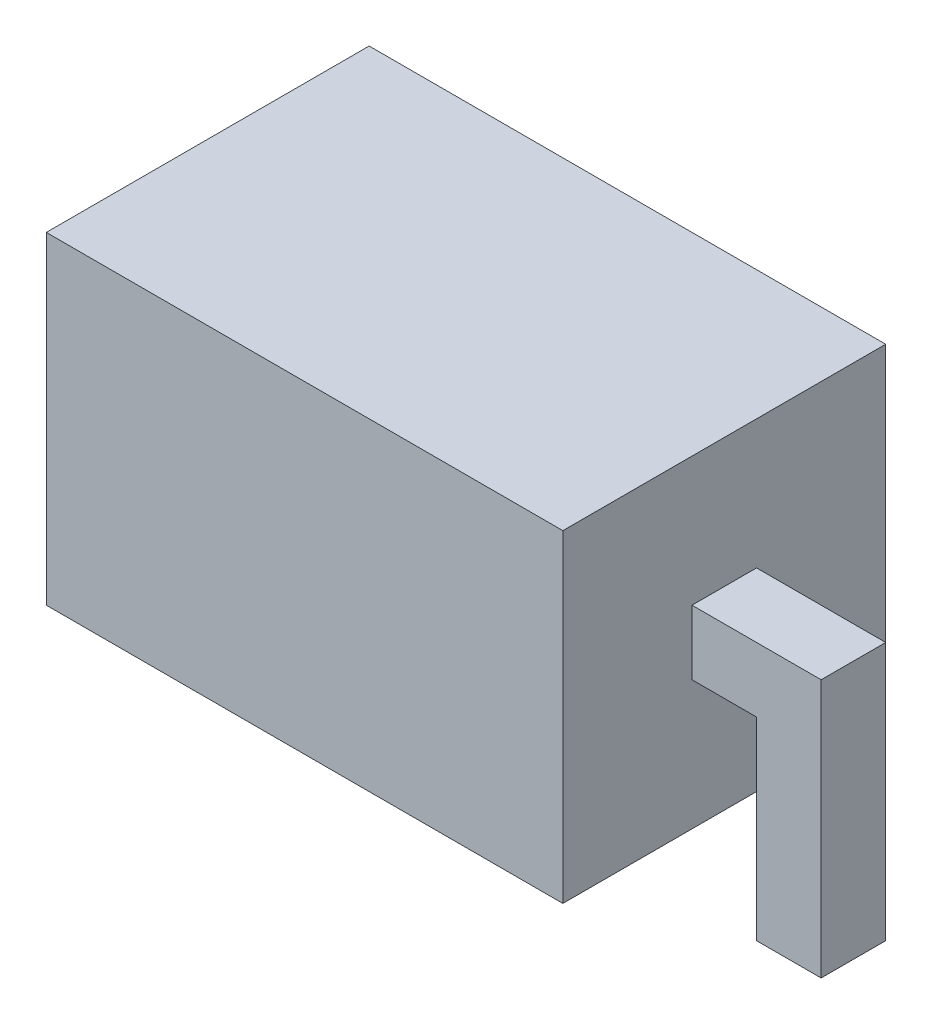
ISO-10303-21;
HEADER;
FILE_DESCRIPTION(('STEP AP214'),'2;1');
FILE_NAME('part.step','',(''),(''),'','','');
FILE_SCHEMA(('AUTOMOTIVE_DESIGN { 1 0 10303 214 1 1 1 1 }'));
ENDSEC;
DATA;
#1=APPLICATION_CONTEXT('core data for automotive mechanical design processes');
#2=APPLICATION_PROTOCOL_DEFINITION('international standard','automotive_design',2000,#1);
#3=PRODUCT_CONTEXT('',#1,'mechanical');
#4=PRODUCT('Part','Part','',(#3));
#5=PRODUCT_RELATED_PRODUCT_CATEGORY('part','',(#4));
#6=PRODUCT_DEFINITION_FORMATION('','',#4);
#7=PRODUCT_DEFINITION_CONTEXT('part definition',#1,'design');
#8=PRODUCT_DEFINITION('design','',#6,#7);
#9=PRODUCT_DEFINITION_SHAPE('','',#8);
#10=(LENGTH_UNIT() NAMED_UNIT(*) SI_UNIT(.MILLI.,.METRE.));
#11=(NAMED_UNIT(*) PLANE_ANGLE_UNIT() SI_UNIT($,.RADIAN.));
#12=(NAMED_UNIT(*) SI_UNIT($,.STERADIAN.) SOLID_ANGLE_UNIT());
#13=UNCERTAINTY_MEASURE_WITH_UNIT(LENGTH_MEASURE(1.E-05),#10,'distance_accuracy_value','');
#14=(GEOMETRIC_REPRESENTATION_CONTEXT(3) GLOBAL_UNCERTAINTY_ASSIGNED_CONTEXT((#13)) GLOBAL_UNIT_ASSIGNED_CONTEXT((#10,
#11,#12)) REPRESENTATION_CONTEXT('',''));
#15=CARTESIAN_POINT('',(0.,0.,0.));
#16=DIRECTION('',(0.,0.,1.));
#17=DIRECTION('',(1.,0.,0.));
#18=AXIS2_PLACEMENT_3D('',#15,#16,#17);
#19=CARTESIAN_POINT('',(2.,-1.25,2.5));
#20=DIRECTION('',(-1.,0.,0.));
#21=DIRECTION('',(0.,0.,1.));
#22=AXIS2_PLACEMENT_3D('',#19,#20,#21);
#23=PLANE('',#22);
#24=DIRECTION('',(0.,1.,0.));
#25=VECTOR('',#24,1.);
#26=CARTESIAN_POINT('',(2.,0.,1.));
#27=LINE('',#26,#25);
#28=CARTESIAN_POINT('',(1.99999999999999,-0.25,1.));
#29=VERTEX_POINT('',#28);
#30=CARTESIAN_POINT('',(2.,0.25,1.));
#31=VERTEX_POINT('',#30);
#32=EDGE_CURVE('E230',#29,#31,#27,.T.);
#33=ORIENTED_EDGE('',*,*,#32,.F.);
#34=DIRECTION('',(0.,0.,1.));
#35=VECTOR('',#34,1.);
#36=CARTESIAN_POINT('',(1.99999999999999,-0.25,1.));
#37=LINE('',#36,#35);
#38=CARTESIAN_POINT('',(1.99999999999999,-0.25,1.5));
#39=VERTEX_POINT('',#38);
#40=EDGE_CURVE('E58',#29,#39,#37,.T.);
#41=ORIENTED_EDGE('',*,*,#40,.T.);
#42=DIRECTION('',(0.,1.,0.));
#43=VECTOR('',#42,1.);
#44=CARTESIAN_POINT('',(2.,0.,1.5));
#45=LINE('',#44,#43);
#46=CARTESIAN_POINT('',(2.,0.25,1.5));
#47=VERTEX_POINT('',#46);
#48=EDGE_CURVE('E214',#39,#47,#45,.T.);
#49=ORIENTED_EDGE('',*,*,#48,.T.);
#50=DIRECTION('',(0.,0.,1.));
#51=VECTOR('',#50,1.);
#52=CARTESIAN_POINT('',(2.,0.25,1.));
#53=LINE('',#52,#51);
#54=EDGE_CURVE('E246',#31,#47,#53,.T.);
#55=ORIENTED_EDGE('',*,*,#54,.F.);
#56=EDGE_LOOP('',(#33,#41,#49,#55));
#57=FACE_BOUND('',#56,.T.);
#58=DIRECTION('',(0.,1.,0.));
#59=VECTOR('',#58,1.);
#60=CARTESIAN_POINT('',(2.,-1.25,0.));
#61=LINE('',#60,#59);
#62=CARTESIAN_POINT('',(2.,-1.25,0.));
#63=VERTEX_POINT('',#62);
#64=CARTESIAN_POINT('',(2.,1.25,0.));
#65=VERTEX_POINT('',#64);
#66=EDGE_CURVE('E242',#63,#65,#61,.T.);
#67=ORIENTED_EDGE('',*,*,#66,.T.);
#68=DIRECTION('',(0.,0.,-1.));
#69=VECTOR('',#68,1.);
#70=CARTESIAN_POINT('',(2.,1.25,2.5));
#71=LINE('',#70,#69);
#72=CARTESIAN_POINT('',(2.,1.25,2.5));
#73=VERTEX_POINT('',#72);
#74=EDGE_CURVE('E11',#73,#65,#71,.T.);
#75=ORIENTED_EDGE('',*,*,#74,.F.);
#76=DIRECTION('',(0.,1.,0.));
#77=VECTOR('',#76,1.);
#78=CARTESIAN_POINT('',(2.,-1.25,2.5));
#79=LINE('',#78,#77);
#80=CARTESIAN_POINT('',(2.,-1.25,2.5));
#81=VERTEX_POINT('',#80);
#82=EDGE_CURVE('E252',#81,#73,#79,.T.);
#83=ORIENTED_EDGE('',*,*,#82,.F.);
#84=DIRECTION('',(0.,0.,-1.));
#85=VECTOR('',#84,1.);
#86=CARTESIAN_POINT('',(2.,-1.25,2.5));
#87=LINE('',#86,#85);
#88=EDGE_CURVE('E262',#81,#63,#87,.T.);
#89=ORIENTED_EDGE('',*,*,#88,.T.);
#90=EDGE_LOOP('',(#67,#75,#83,#89));
#91=FACE_BOUND('',#90,.T.);
#92=ADVANCED_FACE('F36',(#57,#91),#23,.F.);
#93=CARTESIAN_POINT('',(-2.,1.25,2.5));
#94=DIRECTION('',(0.,-1.,0.));
#95=DIRECTION('',(0.,0.,-1.));
#96=AXIS2_PLACEMENT_3D('',#93,#94,#95);
#97=PLANE('',#96);
#98=DIRECTION('',(-1.,0.,0.));
#99=VECTOR('',#98,1.);
#100=CARTESIAN_POINT('',(-2.,1.25,0.));
#101=LINE('',#100,#99);
#102=CARTESIAN_POINT('',(-2.,1.25,0.));
#103=VERTEX_POINT('',#102);
#104=EDGE_CURVE('E265',#65,#103,#101,.T.);
#105=ORIENTED_EDGE('',*,*,#104,.T.);
#106=DIRECTION('',(0.,0.,-1.));
#107=VECTOR('',#106,1.);
#108=CARTESIAN_POINT('',(-2.,1.25,2.5));
#109=LINE('',#108,#107);
#110=CARTESIAN_POINT('',(-2.,1.25,2.5));
#111=VERTEX_POINT('',#110);
#112=EDGE_CURVE('E43',#111,#103,#109,.T.);
#113=ORIENTED_EDGE('',*,*,#112,.F.);
#114=DIRECTION('',(-1.,0.,0.));
#115=VECTOR('',#114,1.);
#116=CARTESIAN_POINT('',(-2.,1.25,2.5));
#117=LINE('',#116,#115);
#118=EDGE_CURVE('E255',#73,#111,#117,.T.);
#119=ORIENTED_EDGE('',*,*,#118,.F.);
#120=ORIENTED_EDGE('',*,*,#74,.T.);
#121=EDGE_LOOP('',(#105,#113,#119,#120));
#122=FACE_BOUND('',#121,.T.);
#123=ADVANCED_FACE('F295',(#122),#97,.F.);
#124=CARTESIAN_POINT('',(-2.,-1.25,2.5));
#125=DIRECTION('',(1.,0.,0.));
#126=DIRECTION('',(0.,0.,-1.));
#127=AXIS2_PLACEMENT_3D('',#124,#125,#126);
#128=PLANE('',#127);
#129=DIRECTION('',(0.,1.,0.));
#130=VECTOR('',#129,1.);
#131=CARTESIAN_POINT('',(-1.99999999999999,0.,1.));
#132=LINE('',#131,#130);
#133=CARTESIAN_POINT('',(-1.99999999999999,-0.25,1.));
#134=VERTEX_POINT('',#133);
#135=CARTESIAN_POINT('',(-2.,0.25,1.));
#136=VERTEX_POINT('',#135);
#137=EDGE_CURVE('E188',#134,#136,#132,.T.);
#138=ORIENTED_EDGE('',*,*,#137,.T.);
#139=DIRECTION('',(0.,0.,1.));
#140=VECTOR('',#139,1.);
#141=CARTESIAN_POINT('',(-2.,0.25,1.));
#142=LINE('',#141,#140);
#143=CARTESIAN_POINT('',(-2.,0.25,1.5));
#144=VERTEX_POINT('',#143);
#145=EDGE_CURVE('E202',#136,#144,#142,.T.);
#146=ORIENTED_EDGE('',*,*,#145,.T.);
#147=DIRECTION('',(0.,1.,0.));
#148=VECTOR('',#147,1.);
#149=CARTESIAN_POINT('',(-1.99999999999999,0.,1.5));
#150=LINE('',#149,#148);
#151=CARTESIAN_POINT('',(-1.99999999999999,-0.25,1.5));
#152=VERTEX_POINT('',#151);
#153=EDGE_CURVE('E169',#152,#144,#150,.T.);
#154=ORIENTED_EDGE('',*,*,#153,.F.);
#155=DIRECTION('',(0.,0.,1.));
#156=VECTOR('',#155,1.);
#157=CARTESIAN_POINT('',(-1.99999999999999,-0.25,1.));
#158=LINE('',#157,#156);
#159=EDGE_CURVE('E160',#134,#152,#158,.T.);
#160=ORIENTED_EDGE('',*,*,#159,.F.);
#161=EDGE_LOOP('',(#138,#146,#154,#160));
#162=FACE_BOUND('',#161,.T.);
#163=DIRECTION('',(0.,-1.,0.));
#164=VECTOR('',#163,1.);
#165=CARTESIAN_POINT('',(-2.,-1.25,0.));
#166=LINE('',#165,#164);
#167=CARTESIAN_POINT('',(-2.,-1.25,0.));
#168=VERTEX_POINT('',#167);
#169=EDGE_CURVE('E267',#103,#168,#166,.T.);
#170=ORIENTED_EDGE('',*,*,#169,.T.);
#171=DIRECTION('',(0.,0.,-1.));
#172=VECTOR('',#171,1.);
#173=CARTESIAN_POINT('',(-2.,-1.25,2.5));
#174=LINE('',#173,#172);
#175=CARTESIAN_POINT('',(-2.,-1.25,2.5));
#176=VERTEX_POINT('',#175);
#177=EDGE_CURVE('E272',#176,#168,#174,.T.);
#178=ORIENTED_EDGE('',*,*,#177,.F.);
#179=DIRECTION('',(0.,-1.,0.));
#180=VECTOR('',#179,1.);
#181=CARTESIAN_POINT('',(-2.,-1.25,2.5));
#182=LINE('',#181,#180);
#183=EDGE_CURVE('E258',#111,#176,#182,.T.);
#184=ORIENTED_EDGE('',*,*,#183,.F.);
#185=ORIENTED_EDGE('',*,*,#112,.T.);
#186=EDGE_LOOP('',(#170,#178,#184,#185));
#187=FACE_BOUND('',#186,.T.);
#188=ADVANCED_FACE('F279',(#162,#187),#128,.F.);
#189=CARTESIAN_POINT('',(-2.,-1.25,2.5));
#190=DIRECTION('',(0.,1.,0.));
#191=DIRECTION('',(0.,0.,1.));
#192=AXIS2_PLACEMENT_3D('',#189,#190,#191);
#193=PLANE('',#192);
#194=DIRECTION('',(1.,0.,0.));
#195=VECTOR('',#194,1.);
#196=CARTESIAN_POINT('',(-2.,-1.25,0.));
#197=LINE('',#196,#195);
#198=EDGE_CURVE('E256',#168,#63,#197,.T.);
#199=ORIENTED_EDGE('',*,*,#198,.T.);
#200=ORIENTED_EDGE('',*,*,#88,.F.);
#201=DIRECTION('',(1.,0.,0.));
#202=VECTOR('',#201,1.);
#203=CARTESIAN_POINT('',(-2.,-1.25,2.5));
#204=LINE('',#203,#202);
#205=EDGE_CURVE('E260',#176,#81,#204,.T.);
#206=ORIENTED_EDGE('',*,*,#205,.F.);
#207=ORIENTED_EDGE('',*,*,#177,.T.);
#208=EDGE_LOOP('',(#199,#200,#206,#207));
#209=FACE_BOUND('',#208,.T.);
#210=ADVANCED_FACE('F288',(#209),#193,.F.);
#211=CARTESIAN_POINT('',(0.,0.,2.5));
#212=DIRECTION('',(0.,0.,-1.));
#213=DIRECTION('',(-1.,0.,0.));
#214=AXIS2_PLACEMENT_3D('',#211,#212,#213);
#215=PLANE('',#214);
#216=ORIENTED_EDGE('',*,*,#82,.T.);
#217=ORIENTED_EDGE('',*,*,#118,.T.);
#218=ORIENTED_EDGE('',*,*,#183,.T.);
#219=ORIENTED_EDGE('',*,*,#205,.T.);
#220=EDGE_LOOP('',(#216,#217,#218,#219));
#221=FACE_BOUND('',#220,.T.);
#222=ADVANCED_FACE('F294',(#221),#215,.F.);
#223=CARTESIAN_POINT('',(0.,0.,0.));
#224=DIRECTION('',(0.,0.,-1.));
#225=DIRECTION('',(-1.,0.,0.));
#226=AXIS2_PLACEMENT_3D('',#223,#224,#225);
#227=PLANE('',#226);
#228=ORIENTED_EDGE('',*,*,#66,.F.);
#229=ORIENTED_EDGE('',*,*,#198,.F.);
#230=ORIENTED_EDGE('',*,*,#169,.F.);
#231=ORIENTED_EDGE('',*,*,#104,.F.);
#232=EDGE_LOOP('',(#228,#229,#230,#231));
#233=FACE_BOUND('',#232,.T.);
#234=ADVANCED_FACE('F285',(#233),#227,.T.);
#235=CARTESIAN_POINT('',(0.,-1.75,1.));
#236=DIRECTION('',(0.,-1.,0.));
#237=DIRECTION('',(0.,0.,-1.));
#238=AXIS2_PLACEMENT_3D('',#235,#236,#237);
#239=PLANE('',#238);
#240=DIRECTION('',(0.,0.,1.));
#241=VECTOR('',#240,1.);
#242=CARTESIAN_POINT('',(3.,-1.75,1.));
#243=LINE('',#242,#241);
#244=CARTESIAN_POINT('',(3.,-1.75,1.));
#245=VERTEX_POINT('',#244);
#246=CARTESIAN_POINT('',(3.,-1.75,1.5));
#247=VERTEX_POINT('',#246);
#248=EDGE_CURVE('E239',#245,#247,#243,.T.);
#249=ORIENTED_EDGE('',*,*,#248,.T.);
#250=DIRECTION('',(1.,0.,0.));
#251=VECTOR('',#250,1.);
#252=CARTESIAN_POINT('',(0.,-1.75,1.5));
#253=LINE('',#252,#251);
#254=CARTESIAN_POINT('',(2.5,-1.75,1.5));
#255=VERTEX_POINT('',#254);
#256=EDGE_CURVE('E197',#255,#247,#253,.T.);
#257=ORIENTED_EDGE('',*,*,#256,.F.);
#258=DIRECTION('',(0.,0.,1.));
#259=VECTOR('',#258,1.);
#260=CARTESIAN_POINT('',(2.5,-1.75,1.));
#261=LINE('',#260,#259);
#262=CARTESIAN_POINT('',(2.5,-1.75,1.));
#263=VERTEX_POINT('',#262);
#264=EDGE_CURVE('E240',#263,#255,#261,.T.);
#265=ORIENTED_EDGE('',*,*,#264,.F.);
#266=DIRECTION('',(1.,0.,0.));
#267=VECTOR('',#266,1.);
#268=CARTESIAN_POINT('',(0.,-1.75,1.));
#269=LINE('',#268,#267);
#270=EDGE_CURVE('E222',#263,#245,#269,.T.);
#271=ORIENTED_EDGE('',*,*,#270,.T.);
#272=EDGE_LOOP('',(#249,#257,#265,#271));
#273=FACE_BOUND('',#272,.T.);
#274=ADVANCED_FACE('F308',(#273),#239,.T.);
#275=CARTESIAN_POINT('',(2.5,0.,1.));
#276=DIRECTION('',(-1.,0.,0.));
#277=DIRECTION('',(0.,-1.,0.));
#278=AXIS2_PLACEMENT_3D('',#275,#276,#277);
#279=PLANE('',#278);
#280=ORIENTED_EDGE('',*,*,#264,.T.);
#281=DIRECTION('',(0.,-1.,0.));
#282=VECTOR('',#281,1.);
#283=CARTESIAN_POINT('',(2.5,0.,1.5));
#284=LINE('',#283,#282);
#285=CARTESIAN_POINT('',(2.5,-0.25,1.5));
#286=VERTEX_POINT('',#285);
#287=EDGE_CURVE('E219',#286,#255,#284,.T.);
#288=ORIENTED_EDGE('',*,*,#287,.F.);
#289=DIRECTION('',(0.,0.,1.));
#290=VECTOR('',#289,1.);
#291=CARTESIAN_POINT('',(2.5,-0.25,1.));
#292=LINE('',#291,#290);
#293=CARTESIAN_POINT('',(2.5,-0.25,1.));
#294=VERTEX_POINT('',#293);
#295=EDGE_CURVE('E243',#294,#286,#292,.T.);
#296=ORIENTED_EDGE('',*,*,#295,.F.);
#297=DIRECTION('',(0.,-1.,0.));
#298=VECTOR('',#297,1.);
#299=CARTESIAN_POINT('',(2.5,0.,1.));
#300=LINE('',#299,#298);
#301=EDGE_CURVE('E236',#294,#263,#300,.T.);
#302=ORIENTED_EDGE('',*,*,#301,.T.);
#303=EDGE_LOOP('',(#280,#288,#296,#302));
#304=FACE_BOUND('',#303,.T.);
#305=ADVANCED_FACE('F313',(#304),#279,.T.);
#306=CARTESIAN_POINT('',(0.,-0.249999999999998,1.));
#307=DIRECTION('',(0.,1.,0.));
#308=DIRECTION('',(-1.,0.,0.));
#309=AXIS2_PLACEMENT_3D('',#306,#307,#308);
#310=PLANE('',#309);
#311=ORIENTED_EDGE('',*,*,#295,.T.);
#312=DIRECTION('',(-1.,0.,0.));
#313=VECTOR('',#312,1.);
#314=CARTESIAN_POINT('',(0.,-0.249999999999998,1.5));
#315=LINE('',#314,#313);
#316=EDGE_CURVE('E216',#286,#39,#315,.T.);
#317=ORIENTED_EDGE('',*,*,#316,.T.);
#318=ORIENTED_EDGE('',*,*,#40,.F.);
#319=DIRECTION('',(-1.,0.,0.));
#320=VECTOR('',#319,1.);
#321=CARTESIAN_POINT('',(0.,-0.249999999999998,1.));
#322=LINE('',#321,#320);
#323=EDGE_CURVE('E233',#294,#29,#322,.T.);
#324=ORIENTED_EDGE('',*,*,#323,.F.);
#325=EDGE_LOOP('',(#311,#317,#318,#324));
#326=FACE_BOUND('',#325,.T.);
#327=ADVANCED_FACE('F323',(#326),#310,.F.);
#328=CARTESIAN_POINT('',(0.,0.250000000000001,1.));
#329=DIRECTION('',(0.,-1.,0.));
#330=DIRECTION('',(1.,0.,0.));
#331=AXIS2_PLACEMENT_3D('',#328,#329,#330);
#332=PLANE('',#331);
#333=ORIENTED_EDGE('',*,*,#54,.T.);
#334=DIRECTION('',(1.,0.,0.));
#335=VECTOR('',#334,1.);
#336=CARTESIAN_POINT('',(0.,0.250000000000001,1.5));
#337=LINE('',#336,#335);
#338=CARTESIAN_POINT('',(3.,0.25,1.5));
#339=VERTEX_POINT('',#338);
#340=EDGE_CURVE('E211',#47,#339,#337,.T.);
#341=ORIENTED_EDGE('',*,*,#340,.T.);
#342=DIRECTION('',(0.,0.,1.));
#343=VECTOR('',#342,1.);
#344=CARTESIAN_POINT('',(3.,0.25,1.));
#345=LINE('',#344,#343);
#346=CARTESIAN_POINT('',(3.,0.25,1.));
#347=VERTEX_POINT('',#346);
#348=EDGE_CURVE('E249',#347,#339,#345,.T.);
#349=ORIENTED_EDGE('',*,*,#348,.F.);
#350=DIRECTION('',(1.,0.,0.));
#351=VECTOR('',#350,1.);
#352=CARTESIAN_POINT('',(0.,0.250000000000001,1.));
#353=LINE('',#352,#351);
#354=EDGE_CURVE('E228',#31,#347,#353,.T.);
#355=ORIENTED_EDGE('',*,*,#354,.F.);
#356=EDGE_LOOP('',(#333,#341,#349,#355));
#357=FACE_BOUND('',#356,.T.);
#358=ADVANCED_FACE('F319',(#357),#332,.F.);
#359=CARTESIAN_POINT('',(3.,0.,1.));
#360=DIRECTION('',(1.,0.,0.));
#361=DIRECTION('',(0.,0.,-1.));
#362=AXIS2_PLACEMENT_3D('',#359,#360,#361);
#363=PLANE('',#362);
#364=ORIENTED_EDGE('',*,*,#348,.T.);
#365=DIRECTION('',(0.,1.,0.));
#366=VECTOR('',#365,1.);
#367=CARTESIAN_POINT('',(3.,0.,1.5));
#368=LINE('',#367,#366);
#369=EDGE_CURVE('E208',#247,#339,#368,.T.);
#370=ORIENTED_EDGE('',*,*,#369,.F.);
#371=ORIENTED_EDGE('',*,*,#248,.F.);
#372=DIRECTION('',(0.,1.,0.));
#373=VECTOR('',#372,1.);
#374=CARTESIAN_POINT('',(3.,0.,1.));
#375=LINE('',#374,#373);
#376=EDGE_CURVE('E225',#245,#347,#375,.T.);
#377=ORIENTED_EDGE('',*,*,#376,.T.);
#378=EDGE_LOOP('',(#364,#370,#371,#377));
#379=FACE_BOUND('',#378,.T.);
#380=ADVANCED_FACE('F315',(#379),#363,.T.);
#381=CARTESIAN_POINT('',(0.,0.,1.));
#382=DIRECTION('',(0.,0.,1.));
#383=DIRECTION('',(1.,0.,0.));
#384=AXIS2_PLACEMENT_3D('',#381,#382,#383);
#385=PLANE('',#384);
#386=ORIENTED_EDGE('',*,*,#270,.F.);
#387=ORIENTED_EDGE('',*,*,#301,.F.);
#388=ORIENTED_EDGE('',*,*,#323,.T.);
#389=ORIENTED_EDGE('',*,*,#32,.T.);
#390=ORIENTED_EDGE('',*,*,#354,.T.);
#391=ORIENTED_EDGE('',*,*,#376,.F.);
#392=EDGE_LOOP('',(#386,#387,#388,#389,#390,#391));
#393=FACE_BOUND('',#392,.T.);
#394=ADVANCED_FACE('F318',(#393),#385,.F.);
#395=CARTESIAN_POINT('',(0.,0.,1.5));
#396=DIRECTION('',(0.,0.,1.));
#397=DIRECTION('',(1.,0.,0.));
#398=AXIS2_PLACEMENT_3D('',#395,#396,#397);
#399=PLANE('',#398);
#400=ORIENTED_EDGE('',*,*,#256,.T.);
#401=ORIENTED_EDGE('',*,*,#369,.T.);
#402=ORIENTED_EDGE('',*,*,#340,.F.);
#403=ORIENTED_EDGE('',*,*,#48,.F.);
#404=ORIENTED_EDGE('',*,*,#316,.F.);
#405=ORIENTED_EDGE('',*,*,#287,.T.);
#406=EDGE_LOOP('',(#400,#401,#402,#403,#404,#405));
#407=FACE_BOUND('',#406,.T.);
#408=ADVANCED_FACE('F333',(#407),#399,.T.);
#409=CARTESIAN_POINT('',(-2.5,0.,1.));
#410=DIRECTION('',(-1.,0.,0.));
#411=DIRECTION('',(0.,0.,1.));
#412=AXIS2_PLACEMENT_3D('',#409,#410,#411);
#413=PLANE('',#412);
#414=DIRECTION('',(0.,0.,1.));
#415=VECTOR('',#414,1.);
#416=CARTESIAN_POINT('',(-2.5,-0.25,1.));
#417=LINE('',#416,#415);
#418=CARTESIAN_POINT('',(-2.5,-0.25,1.));
#419=VERTEX_POINT('',#418);
#420=CARTESIAN_POINT('',(-2.5,-0.25,1.5));
#421=VERTEX_POINT('',#420);
#422=EDGE_CURVE('E148',#419,#421,#417,.T.);
#423=ORIENTED_EDGE('',*,*,#422,.T.);
#424=DIRECTION('',(0.,-1.,0.));
#425=VECTOR('',#424,1.);
#426=CARTESIAN_POINT('',(-2.5,0.,1.5));
#427=LINE('',#426,#425);
#428=CARTESIAN_POINT('',(-2.5,-1.75,1.5));
#429=VERTEX_POINT('',#428);
#430=EDGE_CURVE('E153',#421,#429,#427,.T.);
#431=ORIENTED_EDGE('',*,*,#430,.T.);
#432=DIRECTION('',(0.,0.,1.));
#433=VECTOR('',#432,1.);
#434=CARTESIAN_POINT('',(-2.5,-1.75,1.));
#435=LINE('',#434,#433);
#436=CARTESIAN_POINT('',(-2.5,-1.75,1.));
#437=VERTEX_POINT('',#436);
#438=EDGE_CURVE('E195',#437,#429,#435,.T.);
#439=ORIENTED_EDGE('',*,*,#438,.F.);
#440=DIRECTION('',(0.,-1.,0.));
#441=VECTOR('',#440,1.);
#442=CARTESIAN_POINT('',(-2.5,0.,1.));
#443=LINE('',#442,#441);
#444=EDGE_CURVE('E156',#419,#437,#443,.T.);
#445=ORIENTED_EDGE('',*,*,#444,.F.);
#446=EDGE_LOOP('',(#423,#431,#439,#445));
#447=FACE_BOUND('',#446,.T.);
#448=ADVANCED_FACE('F150',(#447),#413,.F.);
#449=CARTESIAN_POINT('',(0.,-1.75,1.));
#450=DIRECTION('',(0.,1.,0.));
#451=DIRECTION('',(0.,0.,1.));
#452=AXIS2_PLACEMENT_3D('',#449,#450,#451);
#453=PLANE('',#452);
#454=ORIENTED_EDGE('',*,*,#438,.T.);
#455=DIRECTION('',(-1.,0.,0.));
#456=VECTOR('',#455,1.);
#457=CARTESIAN_POINT('',(0.,-1.75,1.5));
#458=LINE('',#457,#456);
#459=CARTESIAN_POINT('',(-3.,-1.75,1.5));
#460=VERTEX_POINT('',#459);
#461=EDGE_CURVE('E174',#429,#460,#458,.T.);
#462=ORIENTED_EDGE('',*,*,#461,.T.);
#463=DIRECTION('',(0.,0.,1.));
#464=VECTOR('',#463,1.);
#465=CARTESIAN_POINT('',(-3.,-1.75,1.));
#466=LINE('',#465,#464);
#467=CARTESIAN_POINT('',(-3.,-1.75,1.));
#468=VERTEX_POINT('',#467);
#469=EDGE_CURVE('E198',#468,#460,#466,.T.);
#470=ORIENTED_EDGE('',*,*,#469,.F.);
#471=DIRECTION('',(-1.,0.,0.));
#472=VECTOR('',#471,1.);
#473=CARTESIAN_POINT('',(0.,-1.75,1.));
#474=LINE('',#473,#472);
#475=EDGE_CURVE('E161',#437,#468,#474,.T.);
#476=ORIENTED_EDGE('',*,*,#475,.F.);
#477=EDGE_LOOP('',(#454,#462,#470,#476));
#478=FACE_BOUND('',#477,.T.);
#479=ADVANCED_FACE('F340',(#478),#453,.F.);
#480=CARTESIAN_POINT('',(-3.,0.,1.));
#481=DIRECTION('',(1.,0.,0.));
#482=DIRECTION('',(0.,1.,0.));
#483=AXIS2_PLACEMENT_3D('',#480,#481,#482);
#484=PLANE('',#483);
#485=ORIENTED_EDGE('',*,*,#469,.T.);
#486=DIRECTION('',(0.,1.,0.));
#487=VECTOR('',#486,1.);
#488=CARTESIAN_POINT('',(-3.,0.,1.5));
#489=LINE('',#488,#487);
#490=CARTESIAN_POINT('',(-3.,0.249999999999999,1.5));
#491=VERTEX_POINT('',#490);
#492=EDGE_CURVE('E181',#460,#491,#489,.T.);
#493=ORIENTED_EDGE('',*,*,#492,.T.);
#494=DIRECTION('',(0.,0.,1.));
#495=VECTOR('',#494,1.);
#496=CARTESIAN_POINT('',(-3.,0.249999999999999,1.));
#497=LINE('',#496,#495);
#498=CARTESIAN_POINT('',(-3.,0.249999999999999,1.));
#499=VERTEX_POINT('',#498);
#500=EDGE_CURVE('E200',#499,#491,#497,.T.);
#501=ORIENTED_EDGE('',*,*,#500,.F.);
#502=DIRECTION('',(0.,1.,0.));
#503=VECTOR('',#502,1.);
#504=CARTESIAN_POINT('',(-3.,0.,1.));
#505=LINE('',#504,#503);
#506=EDGE_CURVE('E192',#468,#499,#505,.T.);
#507=ORIENTED_EDGE('',*,*,#506,.F.);
#508=EDGE_LOOP('',(#485,#493,#501,#507));
#509=FACE_BOUND('',#508,.T.);
#510=ADVANCED_FACE('F347',(#509),#484,.F.);
#511=CARTESIAN_POINT('',(0.,0.250000000000002,1.));
#512=DIRECTION('',(0.,1.,0.));
#513=DIRECTION('',(-1.,0.,0.));
#514=AXIS2_PLACEMENT_3D('',#511,#512,#513);
#515=PLANE('',#514);
#516=ORIENTED_EDGE('',*,*,#500,.T.);
#517=DIRECTION('',(-1.,0.,0.));
#518=VECTOR('',#517,1.);
#519=CARTESIAN_POINT('',(0.,0.250000000000002,1.5));
#520=LINE('',#519,#518);
#521=EDGE_CURVE('E178',#144,#491,#520,.T.);
#522=ORIENTED_EDGE('',*,*,#521,.F.);
#523=ORIENTED_EDGE('',*,*,#145,.F.);
#524=DIRECTION('',(-1.,0.,0.));
#525=VECTOR('',#524,1.);
#526=CARTESIAN_POINT('',(0.,0.250000000000002,1.));
#527=LINE('',#526,#525);
#528=EDGE_CURVE('E50',#136,#499,#527,.T.);
#529=ORIENTED_EDGE('',*,*,#528,.T.);
#530=EDGE_LOOP('',(#516,#522,#523,#529));
#531=FACE_BOUND('',#530,.T.);
#532=ADVANCED_FACE('F344',(#531),#515,.T.);
#533=CARTESIAN_POINT('',(0.,-0.249999999999997,1.));
#534=DIRECTION('',(0.,-1.,0.));
#535=DIRECTION('',(1.,0.,0.));
#536=AXIS2_PLACEMENT_3D('',#533,#534,#535);
#537=PLANE('',#536);
#538=ORIENTED_EDGE('',*,*,#159,.T.);
#539=DIRECTION('',(1.,0.,0.));
#540=VECTOR('',#539,1.);
#541=CARTESIAN_POINT('',(0.,-0.249999999999997,1.5));
#542=LINE('',#541,#540);
#543=EDGE_CURVE('E164',#421,#152,#542,.T.);
#544=ORIENTED_EDGE('',*,*,#543,.F.);
#545=ORIENTED_EDGE('',*,*,#422,.F.);
#546=DIRECTION('',(1.,0.,0.));
#547=VECTOR('',#546,1.);
#548=CARTESIAN_POINT('',(0.,-0.249999999999997,1.));
#549=LINE('',#548,#547);
#550=EDGE_CURVE('E186',#419,#134,#549,.T.);
#551=ORIENTED_EDGE('',*,*,#550,.T.);
#552=EDGE_LOOP('',(#538,#544,#545,#551));
#553=FACE_BOUND('',#552,.T.);
#554=ADVANCED_FACE('F165',(#553),#537,.T.);
#555=CARTESIAN_POINT('',(0.,0.,1.));
#556=DIRECTION('',(0.,0.,1.));
#557=DIRECTION('',(1.,0.,0.));
#558=AXIS2_PLACEMENT_3D('',#555,#556,#557);
#559=PLANE('',#558);
#560=ORIENTED_EDGE('',*,*,#444,.T.);
#561=ORIENTED_EDGE('',*,*,#475,.T.);
#562=ORIENTED_EDGE('',*,*,#506,.T.);
#563=ORIENTED_EDGE('',*,*,#528,.F.);
#564=ORIENTED_EDGE('',*,*,#137,.F.);
#565=ORIENTED_EDGE('',*,*,#550,.F.);
#566=EDGE_LOOP('',(#560,#561,#562,#563,#564,#565));
#567=FACE_BOUND('',#566,.T.);
#568=ADVANCED_FACE('F343',(#567),#559,.F.);
#569=CARTESIAN_POINT('',(0.,0.,1.5));
#570=DIRECTION('',(0.,0.,1.));
#571=DIRECTION('',(1.,0.,0.));
#572=AXIS2_PLACEMENT_3D('',#569,#570,#571);
#573=PLANE('',#572);
#574=ORIENTED_EDGE('',*,*,#430,.F.);
#575=ORIENTED_EDGE('',*,*,#543,.T.);
#576=ORIENTED_EDGE('',*,*,#153,.T.);
#577=ORIENTED_EDGE('',*,*,#521,.T.);
#578=ORIENTED_EDGE('',*,*,#492,.F.);
#579=ORIENTED_EDGE('',*,*,#461,.F.);
#580=EDGE_LOOP('',(#574,#575,#576,#577,#578,#579));
#581=FACE_BOUND('',#580,.T.);
#582=ADVANCED_FACE('F171',(#581),#573,.T.);
#583=CLOSED_SHELL('',(#92,#123,#188,#210,#222,#234,#274,#305,#327,#358,#380,#394,#408,#448,#479,
#510,#532,#554,#568,#582));
#584=MANIFOLD_SOLID_BREP('B2',#583);
#585=ADVANCED_BREP_SHAPE_REPRESENTATION('',(#18,#584),#14);
#586=SHAPE_DEFINITION_REPRESENTATION(#9,#585);
ENDSEC;
END-ISO-10303-21;
